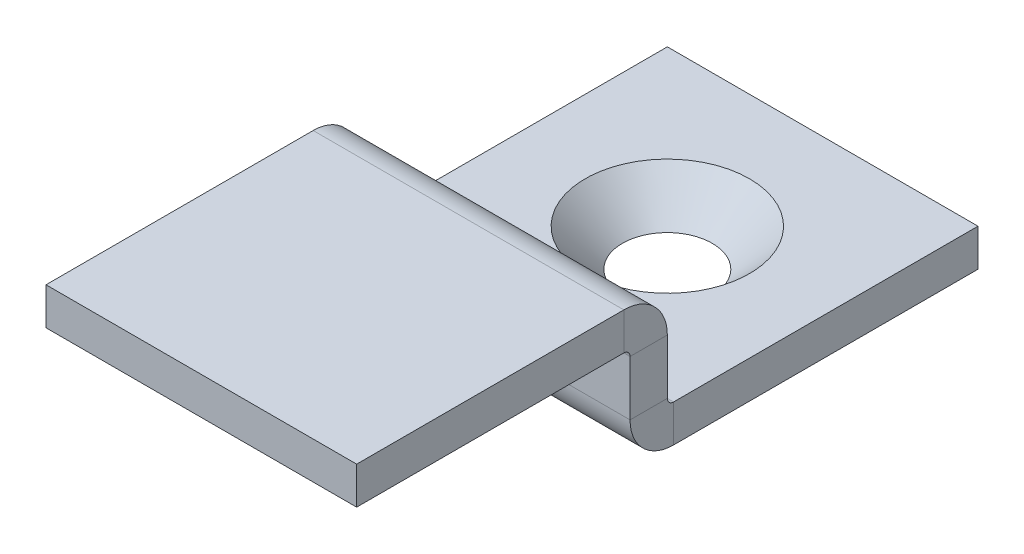
ISO-10303-21;
HEADER;
FILE_DESCRIPTION(('STEP AP214'),'2;1');
FILE_NAME('part.step','',(''),(''),'','','');
FILE_SCHEMA(('AUTOMOTIVE_DESIGN { 1 0 10303 214 1 1 1 1 }'));
ENDSEC;
DATA;
#1=APPLICATION_CONTEXT('core data for automotive mechanical design processes');
#2=APPLICATION_PROTOCOL_DEFINITION('international standard','automotive_design',2000,#1);
#3=PRODUCT_CONTEXT('',#1,'mechanical');
#4=PRODUCT('Part','Part','',(#3));
#5=PRODUCT_RELATED_PRODUCT_CATEGORY('part','',(#4));
#6=PRODUCT_DEFINITION_FORMATION('','',#4);
#7=PRODUCT_DEFINITION_CONTEXT('part definition',#1,'design');
#8=PRODUCT_DEFINITION('design','',#6,#7);
#9=PRODUCT_DEFINITION_SHAPE('','',#8);
#10=(LENGTH_UNIT() NAMED_UNIT(*) SI_UNIT(.MILLI.,.METRE.));
#11=(NAMED_UNIT(*) PLANE_ANGLE_UNIT() SI_UNIT($,.RADIAN.));
#12=(NAMED_UNIT(*) SI_UNIT($,.STERADIAN.) SOLID_ANGLE_UNIT());
#13=UNCERTAINTY_MEASURE_WITH_UNIT(LENGTH_MEASURE(1.E-05),#10,'distance_accuracy_value','');
#14=(GEOMETRIC_REPRESENTATION_CONTEXT(3) GLOBAL_UNCERTAINTY_ASSIGNED_CONTEXT((#13)) GLOBAL_UNIT_ASSIGNED_CONTEXT((#10,
#11,#12)) REPRESENTATION_CONTEXT('',''));
#15=CARTESIAN_POINT('',(0.,0.,0.));
#16=DIRECTION('',(0.,0.,1.));
#17=DIRECTION('',(1.,0.,0.));
#18=AXIS2_PLACEMENT_3D('',#15,#16,#17);
#19=CARTESIAN_POINT('',(0.,0.,14.224));
#20=DIRECTION('',(1.,0.,0.));
#21=DIRECTION('',(0.,0.,-1.));
#22=AXIS2_PLACEMENT_3D('',#19,#20,#21);
#23=PLANE('',#22);
#24=DIRECTION('',(0.,0.,-1.));
#25=VECTOR('',#24,1.);
#26=CARTESIAN_POINT('',(0.,2.498,14.224));
#27=LINE('',#26,#25);
#28=CARTESIAN_POINT('',(0.,2.498,14.224));
#29=VERTEX_POINT('',#28);
#30=CARTESIAN_POINT('',(0.,2.498,12.7));
#31=VERTEX_POINT('',#30);
#32=EDGE_CURVE('E194',#29,#31,#27,.T.);
#33=ORIENTED_EDGE('',*,*,#32,.T.);
#34=DIRECTION('',(0.,-1.,0.));
#35=VECTOR('',#34,1.);
#36=CARTESIAN_POINT('',(0.,0.,12.7));
#37=LINE('',#36,#35);
#38=CARTESIAN_POINT('',(0.,0.253999999999999,12.7));
#39=VERTEX_POINT('',#38);
#40=EDGE_CURVE('E226',#31,#39,#37,.T.);
#41=ORIENTED_EDGE('',*,*,#40,.T.);
#42=DIRECTION('',(0.,0.,1.));
#43=VECTOR('',#42,1.);
#44=CARTESIAN_POINT('',(0.,0.253999999999999,12.7));
#45=LINE('',#44,#43);
#46=CARTESIAN_POINT('',(0.,0.253999999999999,14.224));
#47=VERTEX_POINT('',#46);
#48=EDGE_CURVE('E215',#39,#47,#45,.T.);
#49=ORIENTED_EDGE('',*,*,#48,.T.);
#50=DIRECTION('',(0.,-1.,0.));
#51=VECTOR('',#50,1.);
#52=CARTESIAN_POINT('',(0.,0.,14.224));
#53=LINE('',#52,#51);
#54=EDGE_CURVE('E227',#29,#47,#53,.T.);
#55=ORIENTED_EDGE('',*,*,#54,.F.);
#56=EDGE_LOOP('',(#33,#41,#49,#55));
#57=FACE_BOUND('',#56,.T.);
#58=ADVANCED_FACE('F59',(#57),#23,.F.);
#59=CARTESIAN_POINT('',(12.7,4.276,14.224));
#60=DIRECTION('',(-1.,0.,0.));
#61=DIRECTION('',(0.,0.,1.));
#62=AXIS2_PLACEMENT_3D('',#59,#60,#61);
#63=PLANE('',#62);
#64=DIRECTION('',(0.,0.,-1.));
#65=VECTOR('',#64,1.);
#66=CARTESIAN_POINT('',(12.7,2.498,14.224));
#67=LINE('',#66,#65);
#68=CARTESIAN_POINT('',(12.7,2.498,14.224));
#69=VERTEX_POINT('',#68);
#70=CARTESIAN_POINT('',(12.7,2.498,12.7));
#71=VERTEX_POINT('',#70);
#72=EDGE_CURVE('E205',#69,#71,#67,.T.);
#73=ORIENTED_EDGE('',*,*,#72,.F.);
#74=DIRECTION('',(0.,1.,0.));
#75=VECTOR('',#74,1.);
#76=CARTESIAN_POINT('',(12.7,4.276,14.224));
#77=LINE('',#76,#75);
#78=CARTESIAN_POINT('',(12.7,0.253999999999999,14.224));
#79=VERTEX_POINT('',#78);
#80=EDGE_CURVE('E229',#79,#69,#77,.T.);
#81=ORIENTED_EDGE('',*,*,#80,.F.);
#82=DIRECTION('',(0.,0.,1.));
#83=VECTOR('',#82,1.);
#84=CARTESIAN_POINT('',(12.7,0.253999999999999,12.7));
#85=LINE('',#84,#83);
#86=CARTESIAN_POINT('',(12.7,0.253999999999999,12.7));
#87=VERTEX_POINT('',#86);
#88=EDGE_CURVE('E218',#87,#79,#85,.T.);
#89=ORIENTED_EDGE('',*,*,#88,.F.);
#90=DIRECTION('',(0.,1.,0.));
#91=VECTOR('',#90,1.);
#92=CARTESIAN_POINT('',(12.7,4.276,12.7));
#93=LINE('',#92,#91);
#94=EDGE_CURVE('E230',#87,#71,#93,.T.);
#95=ORIENTED_EDGE('',*,*,#94,.T.);
#96=EDGE_LOOP('',(#73,#81,#89,#95));
#97=FACE_BOUND('',#96,.T.);
#98=ADVANCED_FACE('F307',(#97),#63,.F.);
#99=CARTESIAN_POINT('',(0.,0.,14.224));
#100=DIRECTION('',(0.,0.,-1.));
#101=DIRECTION('',(-1.,0.,0.));
#102=AXIS2_PLACEMENT_3D('',#99,#100,#101);
#103=PLANE('',#102);
#104=DIRECTION('',(-1.,0.,0.));
#105=VECTOR('',#104,1.);
#106=CARTESIAN_POINT('',(0.,2.498,14.224));
#107=LINE('',#106,#105);
#108=EDGE_CURVE('E200',#29,#69,#107,.F.);
#109=ORIENTED_EDGE('',*,*,#108,.F.);
#110=ORIENTED_EDGE('',*,*,#54,.T.);
#111=DIRECTION('',(-1.,0.,0.));
#112=VECTOR('',#111,1.);
#113=CARTESIAN_POINT('',(0.,0.253999999999999,14.224));
#114=LINE('',#113,#112);
#115=EDGE_CURVE('E221',#79,#47,#114,.T.);
#116=ORIENTED_EDGE('',*,*,#115,.F.);
#117=ORIENTED_EDGE('',*,*,#80,.T.);
#118=EDGE_LOOP('',(#109,#110,#116,#117));
#119=FACE_BOUND('',#118,.T.);
#120=ADVANCED_FACE('F310',(#119),#103,.F.);
#121=CARTESIAN_POINT('',(0.,0.,12.7));
#122=DIRECTION('',(0.,0.,-1.));
#123=DIRECTION('',(-1.,0.,0.));
#124=AXIS2_PLACEMENT_3D('',#121,#122,#123);
#125=PLANE('',#124);
#126=ORIENTED_EDGE('',*,*,#40,.F.);
#127=DIRECTION('',(-1.,0.,0.));
#128=VECTOR('',#127,1.);
#129=CARTESIAN_POINT('',(0.,2.498,12.7));
#130=LINE('',#129,#128);
#131=EDGE_CURVE('E189',#31,#71,#130,.F.);
#132=ORIENTED_EDGE('',*,*,#131,.T.);
#133=ORIENTED_EDGE('',*,*,#94,.F.);
#134=DIRECTION('',(1.,0.,0.));
#135=VECTOR('',#134,1.);
#136=CARTESIAN_POINT('',(0.,0.253999999999999,12.7));
#137=LINE('',#136,#135);
#138=EDGE_CURVE('E216',#39,#87,#137,.T.);
#139=ORIENTED_EDGE('',*,*,#138,.F.);
#140=EDGE_LOOP('',(#126,#132,#133,#139));
#141=FACE_BOUND('',#140,.T.);
#142=ADVANCED_FACE('F298',(#141),#125,.T.);
#143=CARTESIAN_POINT('',(0.,-1.524,12.7));
#144=DIRECTION('',(0.,1.,0.));
#145=DIRECTION('',(0.,0.,1.));
#146=AXIS2_PLACEMENT_3D('',#143,#144,#145);
#147=PLANE('',#146);
#148=CARTESIAN_POINT('',(6.35,-1.524,6.35));
#149=DIRECTION('',(0.,1.,0.));
#150=DIRECTION('',(0.,0.,1.));
#151=AXIS2_PLACEMENT_3D('',#148,#149,#150);
#152=CIRCLE('',#151,1.83600000000001);
#153=CARTESIAN_POINT('',(6.35,-1.524,8.18600000000001));
#154=VERTEX_POINT('',#153);
#155=EDGE_CURVE('E212',#154,#154,#152,.T.);
#156=ORIENTED_EDGE('',*,*,#155,.T.);
#157=EDGE_LOOP('',(#156));
#158=FACE_BOUND('',#157,.T.);
#159=DIRECTION('',(1.,0.,0.));
#160=VECTOR('',#159,1.);
#161=CARTESIAN_POINT('',(12.7,-1.524,12.446));
#162=LINE('',#161,#160);
#163=CARTESIAN_POINT('',(12.7,-1.524,12.446));
#164=VERTEX_POINT('',#163);
#165=CARTESIAN_POINT('',(0.,-1.524,12.446));
#166=VERTEX_POINT('',#165);
#167=EDGE_CURVE('E237',#164,#166,#162,.F.);
#168=ORIENTED_EDGE('',*,*,#167,.T.);
#169=DIRECTION('',(0.,0.,-1.));
#170=VECTOR('',#169,1.);
#171=CARTESIAN_POINT('',(0.,-1.524,12.7));
#172=LINE('',#171,#170);
#173=CARTESIAN_POINT('',(0.,-1.524,0.));
#174=VERTEX_POINT('',#173);
#175=EDGE_CURVE('E270',#166,#174,#172,.T.);
#176=ORIENTED_EDGE('',*,*,#175,.T.);
#177=DIRECTION('',(1.,0.,0.));
#178=VECTOR('',#177,1.);
#179=CARTESIAN_POINT('',(0.,-1.524,0.));
#180=LINE('',#179,#178);
#181=CARTESIAN_POINT('',(12.7,-1.524,0.));
#182=VERTEX_POINT('',#181);
#183=EDGE_CURVE('E256',#174,#182,#180,.T.);
#184=ORIENTED_EDGE('',*,*,#183,.T.);
#185=DIRECTION('',(0.,0.,-1.));
#186=VECTOR('',#185,1.);
#187=CARTESIAN_POINT('',(12.7,-1.524,12.7));
#188=LINE('',#187,#186);
#189=EDGE_CURVE('E13',#164,#182,#188,.T.);
#190=ORIENTED_EDGE('',*,*,#189,.F.);
#191=EDGE_LOOP('',(#168,#176,#184,#190));
#192=FACE_BOUND('',#191,.T.);
#193=ADVANCED_FACE('F61',(#158,#192),#147,.F.);
#194=CARTESIAN_POINT('',(12.7,0.,12.7));
#195=DIRECTION('',(1.,0.,0.));
#196=DIRECTION('',(0.,1.,0.));
#197=AXIS2_PLACEMENT_3D('',#194,#195,#196);
#198=PLANE('',#197);
#199=DIRECTION('',(0.,0.,-1.));
#200=VECTOR('',#199,1.);
#201=CARTESIAN_POINT('',(12.7,0.,12.7));
#202=LINE('',#201,#200);
#203=CARTESIAN_POINT('',(12.7,0.,12.446));
#204=VERTEX_POINT('',#203);
#205=CARTESIAN_POINT('',(12.7,0.,0.));
#206=VERTEX_POINT('',#205);
#207=EDGE_CURVE('E67',#204,#206,#202,.T.);
#208=ORIENTED_EDGE('',*,*,#207,.F.);
#209=DIRECTION('',(0.,-1.,0.));
#210=VECTOR('',#209,1.);
#211=CARTESIAN_POINT('',(12.7,0.,12.446));
#212=LINE('',#211,#210);
#213=EDGE_CURVE('E244',#204,#164,#212,.T.);
#214=ORIENTED_EDGE('',*,*,#213,.T.);
#215=ORIENTED_EDGE('',*,*,#189,.T.);
#216=DIRECTION('',(0.,-1.,0.));
#217=VECTOR('',#216,1.);
#218=CARTESIAN_POINT('',(12.7,0.,0.));
#219=LINE('',#218,#217);
#220=EDGE_CURVE('E261',#206,#182,#219,.T.);
#221=ORIENTED_EDGE('',*,*,#220,.F.);
#222=EDGE_LOOP('',(#208,#214,#215,#221));
#223=FACE_BOUND('',#222,.T.);
#224=ADVANCED_FACE('F278',(#223),#198,.T.);
#225=CARTESIAN_POINT('',(0.,0.,12.7));
#226=DIRECTION('',(0.,1.,0.));
#227=DIRECTION('',(0.,0.,1.));
#228=AXIS2_PLACEMENT_3D('',#225,#226,#227);
#229=PLANE('',#228);
#230=CARTESIAN_POINT('',(6.35,0.,6.35));
#231=DIRECTION('',(0.,1.,0.));
#232=DIRECTION('',(0.,0.,1.));
#233=AXIS2_PLACEMENT_3D('',#230,#231,#232);
#234=CIRCLE('',#233,3.36);
#235=CARTESIAN_POINT('',(6.35,0.,9.71));
#236=VERTEX_POINT('',#235);
#237=EDGE_CURVE('E207',#236,#236,#234,.T.);
#238=ORIENTED_EDGE('',*,*,#237,.F.);
#239=EDGE_LOOP('',(#238));
#240=FACE_BOUND('',#239,.T.);
#241=DIRECTION('',(0.,0.,-1.));
#242=VECTOR('',#241,1.);
#243=CARTESIAN_POINT('',(0.,0.,12.7));
#244=LINE('',#243,#242);
#245=CARTESIAN_POINT('',(0.,0.,12.446));
#246=VERTEX_POINT('',#245);
#247=CARTESIAN_POINT('',(0.,0.,0.));
#248=VERTEX_POINT('',#247);
#249=EDGE_CURVE('E272',#246,#248,#244,.T.);
#250=ORIENTED_EDGE('',*,*,#249,.F.);
#251=DIRECTION('',(1.,0.,0.));
#252=VECTOR('',#251,1.);
#253=CARTESIAN_POINT('',(12.7,0.,12.446));
#254=LINE('',#253,#252);
#255=EDGE_CURVE('E82',#204,#246,#254,.F.);
#256=ORIENTED_EDGE('',*,*,#255,.F.);
#257=ORIENTED_EDGE('',*,*,#207,.T.);
#258=DIRECTION('',(1.,0.,0.));
#259=VECTOR('',#258,1.);
#260=CARTESIAN_POINT('',(0.,0.,0.));
#261=LINE('',#260,#259);
#262=EDGE_CURVE('E264',#248,#206,#261,.T.);
#263=ORIENTED_EDGE('',*,*,#262,.F.);
#264=EDGE_LOOP('',(#250,#256,#257,#263));
#265=FACE_BOUND('',#264,.T.);
#266=ADVANCED_FACE('F275',(#240,#265),#229,.T.);
#267=CARTESIAN_POINT('',(0.,-1.524,12.7));
#268=DIRECTION('',(-1.,0.,0.));
#269=DIRECTION('',(0.,0.,1.));
#270=AXIS2_PLACEMENT_3D('',#267,#268,#269);
#271=PLANE('',#270);
#272=DIRECTION('',(0.,-1.,0.));
#273=VECTOR('',#272,1.);
#274=CARTESIAN_POINT('',(0.,0.,12.446));
#275=LINE('',#274,#273);
#276=EDGE_CURVE('E253',#246,#166,#275,.T.);
#277=ORIENTED_EDGE('',*,*,#276,.F.);
#278=ORIENTED_EDGE('',*,*,#249,.T.);
#279=DIRECTION('',(0.,1.,0.));
#280=VECTOR('',#279,1.);
#281=CARTESIAN_POINT('',(0.,-1.524,0.));
#282=LINE('',#281,#280);
#283=EDGE_CURVE('E267',#174,#248,#282,.T.);
#284=ORIENTED_EDGE('',*,*,#283,.F.);
#285=ORIENTED_EDGE('',*,*,#175,.F.);
#286=EDGE_LOOP('',(#277,#278,#284,#285));
#287=FACE_BOUND('',#286,.T.);
#288=ADVANCED_FACE('F284',(#287),#271,.T.);
#289=CARTESIAN_POINT('',(0.,0.,0.));
#290=DIRECTION('',(0.,0.,-1.));
#291=DIRECTION('',(-1.,0.,0.));
#292=AXIS2_PLACEMENT_3D('',#289,#290,#291);
#293=PLANE('',#292);
#294=ORIENTED_EDGE('',*,*,#183,.F.);
#295=ORIENTED_EDGE('',*,*,#283,.T.);
#296=ORIENTED_EDGE('',*,*,#262,.T.);
#297=ORIENTED_EDGE('',*,*,#220,.T.);
#298=EDGE_LOOP('',(#294,#295,#296,#297));
#299=FACE_BOUND('',#298,.T.);
#300=ADVANCED_FACE('F281',(#299),#293,.T.);
#301=CARTESIAN_POINT('',(0.,0.253999999999999,12.446));
#302=DIRECTION('',(-1.,0.,0.));
#303=DIRECTION('',(0.,0.,1.));
#304=AXIS2_PLACEMENT_3D('',#301,#302,#303);
#305=PLANE('',#304);
#306=ORIENTED_EDGE('',*,*,#48,.F.);
#307=CARTESIAN_POINT('',(0.,0.253999999999999,12.446));
#308=DIRECTION('',(1.,0.,0.));
#309=DIRECTION('',(0.,0.,-1.));
#310=AXIS2_PLACEMENT_3D('',#307,#308,#309);
#311=CIRCLE('',#310,0.254000000000001);
#312=EDGE_CURVE('E247',#246,#39,#311,.F.);
#313=ORIENTED_EDGE('',*,*,#312,.F.);
#314=ORIENTED_EDGE('',*,*,#276,.T.);
#315=CARTESIAN_POINT('',(0.,0.253999999999999,12.446));
#316=DIRECTION('',(1.,0.,0.));
#317=DIRECTION('',(0.,0.,-1.));
#318=AXIS2_PLACEMENT_3D('',#315,#316,#317);
#319=CIRCLE('',#318,1.778);
#320=EDGE_CURVE('E240',#166,#47,#319,.F.);
#321=ORIENTED_EDGE('',*,*,#320,.T.);
#322=EDGE_LOOP('',(#306,#313,#314,#321));
#323=FACE_BOUND('',#322,.T.);
#324=ADVANCED_FACE('F292',(#323),#305,.T.);
#325=CARTESIAN_POINT('',(12.7,0.253999999999999,12.446));
#326=DIRECTION('',(-1.,0.,0.));
#327=DIRECTION('',(0.,0.,1.));
#328=AXIS2_PLACEMENT_3D('',#325,#326,#327);
#329=PLANE('',#328);
#330=CARTESIAN_POINT('',(12.7,0.253999999999999,12.446));
#331=DIRECTION('',(1.,0.,0.));
#332=DIRECTION('',(0.,0.,-1.));
#333=AXIS2_PLACEMENT_3D('',#330,#331,#332);
#334=CIRCLE('',#333,0.254000000000001);
#335=EDGE_CURVE('E233',#87,#204,#334,.T.);
#336=ORIENTED_EDGE('',*,*,#335,.F.);
#337=ORIENTED_EDGE('',*,*,#88,.T.);
#338=CARTESIAN_POINT('',(12.7,0.253999999999999,12.446));
#339=DIRECTION('',(1.,0.,0.));
#340=DIRECTION('',(0.,0.,-1.));
#341=AXIS2_PLACEMENT_3D('',#338,#339,#340);
#342=CIRCLE('',#341,1.778);
#343=EDGE_CURVE('E241',#79,#164,#342,.T.);
#344=ORIENTED_EDGE('',*,*,#343,.T.);
#345=ORIENTED_EDGE('',*,*,#213,.F.);
#346=EDGE_LOOP('',(#336,#337,#344,#345));
#347=FACE_BOUND('',#346,.T.);
#348=ADVANCED_FACE('F302',(#347),#329,.F.);
#349=CARTESIAN_POINT('',(12.7,0.253999999999999,12.446));
#350=DIRECTION('',(1.,0.,0.));
#351=DIRECTION('',(0.,0.,1.));
#352=AXIS2_PLACEMENT_3D('',#349,#350,#351);
#353=CYLINDRICAL_SURFACE('',#352,1.778);
#354=ORIENTED_EDGE('',*,*,#167,.F.);
#355=ORIENTED_EDGE('',*,*,#343,.F.);
#356=ORIENTED_EDGE('',*,*,#115,.T.);
#357=ORIENTED_EDGE('',*,*,#320,.F.);
#358=EDGE_LOOP('',(#354,#355,#356,#357));
#359=FACE_BOUND('',#358,.T.);
#360=ADVANCED_FACE('F313',(#359),#353,.T.);
#361=CARTESIAN_POINT('',(12.7,0.253999999999999,12.446));
#362=DIRECTION('',(1.,0.,0.));
#363=DIRECTION('',(0.,0.,1.));
#364=AXIS2_PLACEMENT_3D('',#361,#362,#363);
#365=CYLINDRICAL_SURFACE('',#364,0.254000000000001);
#366=ORIENTED_EDGE('',*,*,#255,.T.);
#367=ORIENTED_EDGE('',*,*,#312,.T.);
#368=ORIENTED_EDGE('',*,*,#138,.T.);
#369=ORIENTED_EDGE('',*,*,#335,.T.);
#370=EDGE_LOOP('',(#366,#367,#368,#369));
#371=FACE_BOUND('',#370,.T.);
#372=ADVANCED_FACE('F287',(#371),#365,.F.);
#373=CARTESIAN_POINT('',(6.35,0.,6.35));
#374=DIRECTION('',(0.,1.,0.));
#375=DIRECTION('',(0.,0.,1.));
#376=AXIS2_PLACEMENT_3D('',#373,#374,#375);
#377=CONICAL_SURFACE('',#376,3.36,0.785398163397445);
#378=ORIENTED_EDGE('',*,*,#237,.T.);
#379=EDGE_LOOP('',(#378));
#380=FACE_BOUND('',#379,.T.);
#381=ORIENTED_EDGE('',*,*,#155,.F.);
#382=EDGE_LOOP('',(#381));
#383=FACE_BOUND('',#382,.T.);
#384=ADVANCED_FACE('F334',(#380,#383),#377,.F.);
#385=CARTESIAN_POINT('',(12.7,2.498,14.478));
#386=DIRECTION('',(1.,0.,0.));
#387=DIRECTION('',(0.,0.,-1.));
#388=AXIS2_PLACEMENT_3D('',#385,#386,#387);
#389=PLANE('',#388);
#390=DIRECTION('',(0.,-1.,0.));
#391=VECTOR('',#390,1.);
#392=CARTESIAN_POINT('',(12.7,4.276,14.478));
#393=LINE('',#392,#391);
#394=CARTESIAN_POINT('',(12.7,2.752,14.478));
#395=VERTEX_POINT('',#394);
#396=CARTESIAN_POINT('',(12.7,4.276,14.478));
#397=VERTEX_POINT('',#396);
#398=EDGE_CURVE('E172',#395,#397,#393,.F.);
#399=ORIENTED_EDGE('',*,*,#398,.F.);
#400=CARTESIAN_POINT('',(12.7,2.498,14.478));
#401=DIRECTION('',(-1.,0.,0.));
#402=DIRECTION('',(0.,0.,1.));
#403=AXIS2_PLACEMENT_3D('',#400,#401,#402);
#404=CIRCLE('',#403,0.254);
#405=EDGE_CURVE('E197',#69,#395,#404,.F.);
#406=ORIENTED_EDGE('',*,*,#405,.F.);
#407=ORIENTED_EDGE('',*,*,#72,.T.);
#408=CARTESIAN_POINT('',(12.7,2.498,14.478));
#409=DIRECTION('',(-1.,0.,0.));
#410=DIRECTION('',(0.,0.,1.));
#411=AXIS2_PLACEMENT_3D('',#408,#409,#410);
#412=CIRCLE('',#411,1.778);
#413=EDGE_CURVE('E74',#71,#397,#412,.F.);
#414=ORIENTED_EDGE('',*,*,#413,.T.);
#415=EDGE_LOOP('',(#399,#406,#407,#414));
#416=FACE_BOUND('',#415,.T.);
#417=ADVANCED_FACE('F351',(#416),#389,.T.);
#418=CARTESIAN_POINT('',(0.,2.498,14.478));
#419=DIRECTION('',(1.,0.,0.));
#420=DIRECTION('',(0.,0.,-1.));
#421=AXIS2_PLACEMENT_3D('',#418,#419,#420);
#422=PLANE('',#421);
#423=CARTESIAN_POINT('',(0.,2.498,14.478));
#424=DIRECTION('',(-1.,0.,0.));
#425=DIRECTION('',(0.,0.,1.));
#426=AXIS2_PLACEMENT_3D('',#423,#424,#425);
#427=CIRCLE('',#426,0.254);
#428=CARTESIAN_POINT('',(0.,2.752,14.478));
#429=VERTEX_POINT('',#428);
#430=EDGE_CURVE('E202',#429,#29,#427,.T.);
#431=ORIENTED_EDGE('',*,*,#430,.F.);
#432=DIRECTION('',(0.,-1.,0.));
#433=VECTOR('',#432,1.);
#434=CARTESIAN_POINT('',(0.,2.752,14.478));
#435=LINE('',#434,#433);
#436=CARTESIAN_POINT('',(0.,4.276,14.478));
#437=VERTEX_POINT('',#436);
#438=EDGE_CURVE('E183',#429,#437,#435,.F.);
#439=ORIENTED_EDGE('',*,*,#438,.T.);
#440=CARTESIAN_POINT('',(0.,2.498,14.478));
#441=DIRECTION('',(-1.,0.,0.));
#442=DIRECTION('',(0.,0.,1.));
#443=AXIS2_PLACEMENT_3D('',#440,#441,#442);
#444=CIRCLE('',#443,1.778);
#445=EDGE_CURVE('E192',#437,#31,#444,.T.);
#446=ORIENTED_EDGE('',*,*,#445,.T.);
#447=ORIENTED_EDGE('',*,*,#32,.F.);
#448=EDGE_LOOP('',(#431,#439,#446,#447));
#449=FACE_BOUND('',#448,.T.);
#450=ADVANCED_FACE('F357',(#449),#422,.F.);
#451=CARTESIAN_POINT('',(0.,2.498,14.478));
#452=DIRECTION('',(-1.,0.,0.));
#453=DIRECTION('',(0.,1.,0.));
#454=AXIS2_PLACEMENT_3D('',#451,#452,#453);
#455=CYLINDRICAL_SURFACE('',#454,1.778);
#456=ORIENTED_EDGE('',*,*,#131,.F.);
#457=ORIENTED_EDGE('',*,*,#445,.F.);
#458=DIRECTION('',(-1.,0.,0.));
#459=VECTOR('',#458,1.);
#460=CARTESIAN_POINT('',(12.7,4.276,14.478));
#461=LINE('',#460,#459);
#462=EDGE_CURVE('E181',#437,#397,#461,.F.);
#463=ORIENTED_EDGE('',*,*,#462,.T.);
#464=ORIENTED_EDGE('',*,*,#413,.F.);
#465=EDGE_LOOP('',(#456,#457,#463,#464));
#466=FACE_BOUND('',#465,.T.);
#467=ADVANCED_FACE('F388',(#466),#455,.T.);
#468=CARTESIAN_POINT('',(0.,2.498,14.478));
#469=DIRECTION('',(-1.,0.,0.));
#470=DIRECTION('',(0.,1.,0.));
#471=AXIS2_PLACEMENT_3D('',#468,#469,#470);
#472=CYLINDRICAL_SURFACE('',#471,0.254);
#473=ORIENTED_EDGE('',*,*,#108,.T.);
#474=ORIENTED_EDGE('',*,*,#405,.T.);
#475=DIRECTION('',(-1.,0.,0.));
#476=VECTOR('',#475,1.);
#477=CARTESIAN_POINT('',(12.7,2.752,14.478));
#478=LINE('',#477,#476);
#479=EDGE_CURVE('E186',#395,#429,#478,.T.);
#480=ORIENTED_EDGE('',*,*,#479,.T.);
#481=ORIENTED_EDGE('',*,*,#430,.T.);
#482=EDGE_LOOP('',(#473,#474,#480,#481));
#483=FACE_BOUND('',#482,.T.);
#484=ADVANCED_FACE('F398',(#483),#472,.F.);
#485=CARTESIAN_POINT('',(12.7,4.276,14.224));
#486=DIRECTION('',(-1.,0.,0.));
#487=DIRECTION('',(0.,0.,1.));
#488=AXIS2_PLACEMENT_3D('',#485,#486,#487);
#489=PLANE('',#488);
#490=ORIENTED_EDGE('',*,*,#398,.T.);
#491=DIRECTION('',(0.,0.,-1.));
#492=VECTOR('',#491,1.);
#493=CARTESIAN_POINT('',(12.7,4.27599999999995,0.));
#494=LINE('',#493,#492);
#495=CARTESIAN_POINT('',(12.7,4.27600000000004,25.4));
#496=VERTEX_POINT('',#495);
#497=EDGE_CURVE('E153',#496,#397,#494,.T.);
#498=ORIENTED_EDGE('',*,*,#497,.F.);
#499=DIRECTION('',(0.,-1.,0.));
#500=VECTOR('',#499,1.);
#501=CARTESIAN_POINT('',(12.7,4.27600000000004,25.4));
#502=LINE('',#501,#500);
#503=CARTESIAN_POINT('',(12.7,2.75200000000004,25.4));
#504=VERTEX_POINT('',#503);
#505=EDGE_CURVE('E159',#496,#504,#502,.T.);
#506=ORIENTED_EDGE('',*,*,#505,.T.);
#507=DIRECTION('',(0.,0.,1.));
#508=VECTOR('',#507,1.);
#509=CARTESIAN_POINT('',(12.7,2.752,14.224));
#510=LINE('',#509,#508);
#511=EDGE_CURVE('E179',#504,#395,#510,.F.);
#512=ORIENTED_EDGE('',*,*,#511,.T.);
#513=EDGE_LOOP('',(#490,#498,#506,#512));
#514=FACE_BOUND('',#513,.T.);
#515=ADVANCED_FACE('F171',(#514),#489,.F.);
#516=CARTESIAN_POINT('',(0.,4.27600000000004,25.4));
#517=DIRECTION('',(1.,0.,0.));
#518=DIRECTION('',(0.,0.,-1.));
#519=AXIS2_PLACEMENT_3D('',#516,#517,#518);
#520=PLANE('',#519);
#521=ORIENTED_EDGE('',*,*,#438,.F.);
#522=DIRECTION('',(0.,0.,-1.));
#523=VECTOR('',#522,1.);
#524=CARTESIAN_POINT('',(0.,2.75200000000004,25.4));
#525=LINE('',#524,#523);
#526=CARTESIAN_POINT('',(0.,2.75200000000004,25.4));
#527=VERTEX_POINT('',#526);
#528=EDGE_CURVE('E175',#429,#527,#525,.F.);
#529=ORIENTED_EDGE('',*,*,#528,.T.);
#530=DIRECTION('',(0.,-1.,0.));
#531=VECTOR('',#530,1.);
#532=CARTESIAN_POINT('',(0.,4.27600000000004,25.4));
#533=LINE('',#532,#531);
#534=CARTESIAN_POINT('',(0.,4.27600000000004,25.4));
#535=VERTEX_POINT('',#534);
#536=EDGE_CURVE('E168',#535,#527,#533,.T.);
#537=ORIENTED_EDGE('',*,*,#536,.F.);
#538=DIRECTION('',(0.,0.,1.));
#539=VECTOR('',#538,1.);
#540=CARTESIAN_POINT('',(0.,4.27599999999995,0.));
#541=LINE('',#540,#539);
#542=EDGE_CURVE('E155',#437,#535,#541,.T.);
#543=ORIENTED_EDGE('',*,*,#542,.F.);
#544=EDGE_LOOP('',(#521,#529,#537,#543));
#545=FACE_BOUND('',#544,.T.);
#546=ADVANCED_FACE('F418',(#545),#520,.F.);
#547=CARTESIAN_POINT('',(0.,4.27599999999995,0.));
#548=DIRECTION('',(0.,-1.,0.));
#549=DIRECTION('',(0.,0.,-1.));
#550=AXIS2_PLACEMENT_3D('',#547,#548,#549);
#551=PLANE('',#550);
#552=ORIENTED_EDGE('',*,*,#462,.F.);
#553=ORIENTED_EDGE('',*,*,#542,.T.);
#554=DIRECTION('',(1.,0.,0.));
#555=VECTOR('',#554,1.);
#556=CARTESIAN_POINT('',(0.,4.27600000000004,25.4));
#557=LINE('',#556,#555);
#558=EDGE_CURVE('E148',#535,#496,#557,.T.);
#559=ORIENTED_EDGE('',*,*,#558,.T.);
#560=ORIENTED_EDGE('',*,*,#497,.T.);
#561=EDGE_LOOP('',(#552,#553,#559,#560));
#562=FACE_BOUND('',#561,.T.);
#563=ADVANCED_FACE('F151',(#562),#551,.F.);
#564=CARTESIAN_POINT('',(0.,2.75199999999995,0.));
#565=DIRECTION('',(0.,-1.,0.));
#566=DIRECTION('',(0.,0.,-1.));
#567=AXIS2_PLACEMENT_3D('',#564,#565,#566);
#568=PLANE('',#567);
#569=ORIENTED_EDGE('',*,*,#528,.F.);
#570=ORIENTED_EDGE('',*,*,#479,.F.);
#571=ORIENTED_EDGE('',*,*,#511,.F.);
#572=DIRECTION('',(-1.,0.,0.));
#573=VECTOR('',#572,1.);
#574=CARTESIAN_POINT('',(12.7,2.75200000000004,25.4));
#575=LINE('',#574,#573);
#576=EDGE_CURVE('E164',#527,#504,#575,.F.);
#577=ORIENTED_EDGE('',*,*,#576,.F.);
#578=EDGE_LOOP('',(#569,#570,#571,#577));
#579=FACE_BOUND('',#578,.T.);
#580=ADVANCED_FACE('F438',(#579),#568,.T.);
#581=CARTESIAN_POINT('',(12.7,4.27600000000004,25.4));
#582=DIRECTION('',(0.,0.,-1.));
#583=DIRECTION('',(0.,1.,0.));
#584=AXIS2_PLACEMENT_3D('',#581,#582,#583);
#585=PLANE('',#584);
#586=ORIENTED_EDGE('',*,*,#576,.T.);
#587=ORIENTED_EDGE('',*,*,#505,.F.);
#588=ORIENTED_EDGE('',*,*,#558,.F.);
#589=ORIENTED_EDGE('',*,*,#536,.T.);
#590=EDGE_LOOP('',(#586,#587,#588,#589));
#591=FACE_BOUND('',#590,.T.);
#592=ADVANCED_FACE('F162',(#591),#585,.F.);
#593=CLOSED_SHELL('',(#58,#98,#120,#142,#193,#224,#266,#288,#300,#324,#348,#360,#372,#384,#417,
#450,#467,#484,#515,#546,#563,#580,#592));
#594=MANIFOLD_SOLID_BREP('B2',#593);
#595=ADVANCED_BREP_SHAPE_REPRESENTATION('',(#18,#594),#14);
#596=SHAPE_DEFINITION_REPRESENTATION(#9,#595);
ENDSEC;
END-ISO-10303-21;
